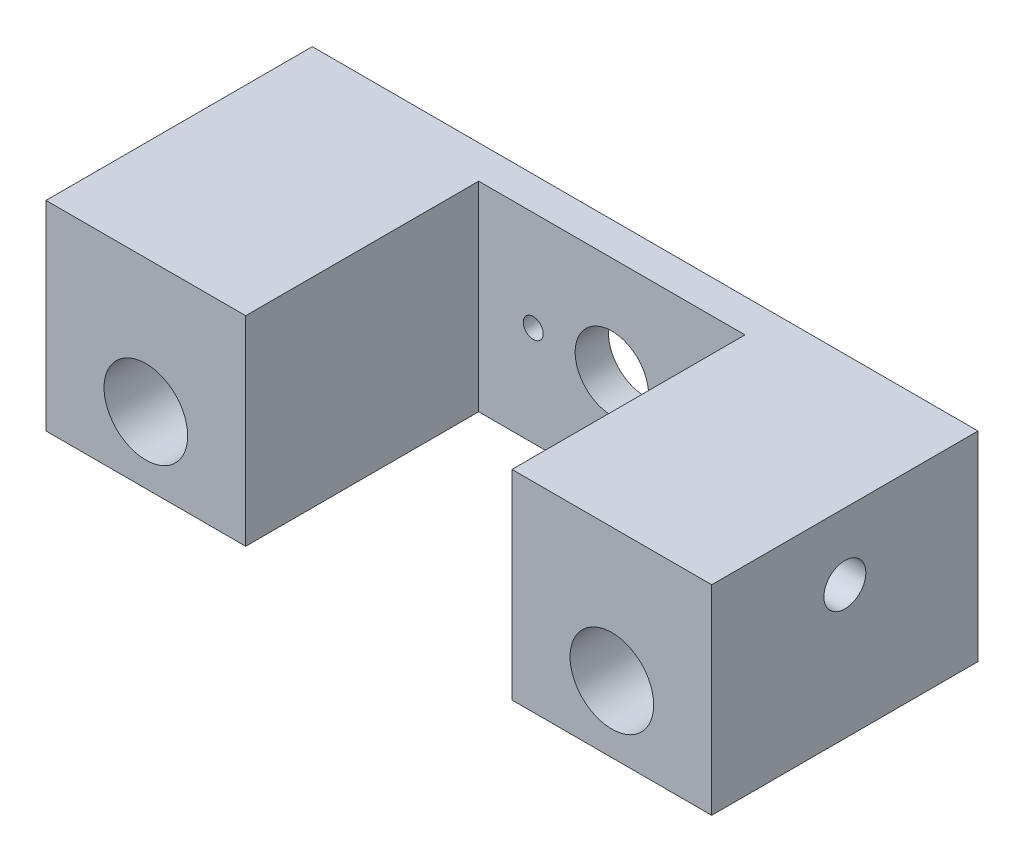
ISO-10303-21;
HEADER;
FILE_DESCRIPTION(('STEP AP214'),'2;1');
FILE_NAME('part.step','',(''),(''),'','','');
FILE_SCHEMA(('AUTOMOTIVE_DESIGN { 1 0 10303 214 1 1 1 1 }'));
ENDSEC;
DATA;
#1=APPLICATION_CONTEXT('core data for automotive mechanical design processes');
#2=APPLICATION_PROTOCOL_DEFINITION('international standard','automotive_design',2000,#1);
#3=PRODUCT_CONTEXT('',#1,'mechanical');
#4=PRODUCT('Part','Part','',(#3));
#5=PRODUCT_RELATED_PRODUCT_CATEGORY('part','',(#4));
#6=PRODUCT_DEFINITION_FORMATION('','',#4);
#7=PRODUCT_DEFINITION_CONTEXT('part definition',#1,'design');
#8=PRODUCT_DEFINITION('design','',#6,#7);
#9=PRODUCT_DEFINITION_SHAPE('','',#8);
#10=(LENGTH_UNIT() NAMED_UNIT(*) SI_UNIT(.MILLI.,.METRE.));
#11=(NAMED_UNIT(*) PLANE_ANGLE_UNIT() SI_UNIT($,.RADIAN.));
#12=(NAMED_UNIT(*) SI_UNIT($,.STERADIAN.) SOLID_ANGLE_UNIT());
#13=UNCERTAINTY_MEASURE_WITH_UNIT(LENGTH_MEASURE(1.E-05),#10,'distance_accuracy_value','');
#14=(GEOMETRIC_REPRESENTATION_CONTEXT(3) GLOBAL_UNCERTAINTY_ASSIGNED_CONTEXT((#13)) GLOBAL_UNIT_ASSIGNED_CONTEXT((#10,
#11,#12)) REPRESENTATION_CONTEXT('',''));
#15=CARTESIAN_POINT('',(0.,0.,0.));
#16=DIRECTION('',(0.,0.,1.));
#17=DIRECTION('',(1.,0.,0.));
#18=AXIS2_PLACEMENT_3D('',#15,#16,#17);
#19=CARTESIAN_POINT('',(0.,0.,0.));
#20=DIRECTION('',(0.,0.,1.));
#21=DIRECTION('',(1.,0.,0.));
#22=AXIS2_PLACEMENT_3D('',#19,#20,#21);
#23=PLANE('',#22);
#24=DIRECTION('',(0.,1.,0.));
#25=VECTOR('',#24,1.);
#26=CARTESIAN_POINT('',(12.7,-9.525,0.));
#27=LINE('',#26,#25);
#28=CARTESIAN_POINT('',(12.7,-9.525,0.));
#29=VERTEX_POINT('',#28);
#30=CARTESIAN_POINT('',(12.7,9.525,0.));
#31=VERTEX_POINT('',#30);
#32=EDGE_CURVE('E117',#29,#31,#27,.T.);
#33=ORIENTED_EDGE('',*,*,#32,.F.);
#34=DIRECTION('',(1.,0.,0.));
#35=VECTOR('',#34,1.);
#36=CARTESIAN_POINT('',(-31.75,-9.52500000000001,0.));
#37=LINE('',#36,#35);
#38=CARTESIAN_POINT('',(31.75,-9.525,0.));
#39=VERTEX_POINT('',#38);
#40=EDGE_CURVE('E84',#29,#39,#37,.T.);
#41=ORIENTED_EDGE('',*,*,#40,.T.);
#42=DIRECTION('',(0.,1.,0.));
#43=VECTOR('',#42,1.);
#44=CARTESIAN_POINT('',(31.75,9.525,0.));
#45=LINE('',#44,#43);
#46=CARTESIAN_POINT('',(31.75,9.525,0.));
#47=VERTEX_POINT('',#46);
#48=EDGE_CURVE('E170',#39,#47,#45,.T.);
#49=ORIENTED_EDGE('',*,*,#48,.T.);
#50=DIRECTION('',(-1.,0.,0.));
#51=VECTOR('',#50,1.);
#52=CARTESIAN_POINT('',(-31.75,9.52499999999999,0.));
#53=LINE('',#52,#51);
#54=EDGE_CURVE('E186',#47,#31,#53,.T.);
#55=ORIENTED_EDGE('',*,*,#54,.T.);
#56=EDGE_LOOP('',(#33,#41,#49,#55));
#57=FACE_BOUND('',#56,.T.);
#58=CARTESIAN_POINT('',(22.225,-3.17500000000001,0.));
#59=DIRECTION('',(0.,0.,1.));
#60=DIRECTION('',(1.,0.,0.));
#61=AXIS2_PLACEMENT_3D('',#58,#59,#60);
#62=CIRCLE('',#61,3.98780000000001);
#63=CARTESIAN_POINT('',(26.2128,-3.17500000000001,0.));
#64=VERTEX_POINT('',#63);
#65=EDGE_CURVE('E158',#64,#64,#62,.T.);
#66=ORIENTED_EDGE('',*,*,#65,.F.);
#67=EDGE_LOOP('',(#66));
#68=FACE_BOUND('',#67,.T.);
#69=ADVANCED_FACE('F37',(#57,#68),#23,.T.);
#70=CARTESIAN_POINT('',(31.75,9.525,-25.4));
#71=DIRECTION('',(1.,0.,0.));
#72=DIRECTION('',(0.,1.,0.));
#73=AXIS2_PLACEMENT_3D('',#70,#71,#72);
#74=PLANE('',#73);
#75=CARTESIAN_POINT('',(31.75,3.17500000000001,-12.7));
#76=DIRECTION('',(-1.,0.,0.));
#77=DIRECTION('',(0.,0.,1.));
#78=AXIS2_PLACEMENT_3D('',#75,#76,#77);
#79=CIRCLE('',#78,2.);
#80=CARTESIAN_POINT('',(31.75,3.17500000000001,-10.7));
#81=VERTEX_POINT('',#80);
#82=EDGE_CURVE('E144',#81,#81,#79,.T.);
#83=ORIENTED_EDGE('',*,*,#82,.T.);
#84=EDGE_LOOP('',(#83));
#85=FACE_BOUND('',#84,.T.);
#86=ORIENTED_EDGE('',*,*,#48,.F.);
#87=DIRECTION('',(0.,0.,1.));
#88=VECTOR('',#87,1.);
#89=CARTESIAN_POINT('',(31.75,-9.525,-25.4));
#90=LINE('',#89,#88);
#91=CARTESIAN_POINT('',(31.75,-9.525,-25.4));
#92=VERTEX_POINT('',#91);
#93=EDGE_CURVE('E11',#92,#39,#90,.T.);
#94=ORIENTED_EDGE('',*,*,#93,.F.);
#95=DIRECTION('',(0.,1.,0.));
#96=VECTOR('',#95,1.);
#97=CARTESIAN_POINT('',(31.75,9.525,-25.4));
#98=LINE('',#97,#96);
#99=CARTESIAN_POINT('',(31.75,9.525,-25.4));
#100=VERTEX_POINT('',#99);
#101=EDGE_CURVE('E173',#92,#100,#98,.T.);
#102=ORIENTED_EDGE('',*,*,#101,.T.);
#103=DIRECTION('',(0.,0.,1.));
#104=VECTOR('',#103,1.);
#105=CARTESIAN_POINT('',(31.75,9.525,-25.4));
#106=LINE('',#105,#104);
#107=EDGE_CURVE('E41',#100,#47,#106,.T.);
#108=ORIENTED_EDGE('',*,*,#107,.T.);
#109=EDGE_LOOP('',(#86,#94,#102,#108));
#110=FACE_BOUND('',#109,.T.);
#111=ADVANCED_FACE('F39',(#85,#110),#74,.T.);
#112=CARTESIAN_POINT('',(-31.75,-9.52500000000001,-25.4));
#113=DIRECTION('',(0.,-1.,0.));
#114=DIRECTION('',(1.,0.,0.));
#115=AXIS2_PLACEMENT_3D('',#112,#113,#114);
#116=PLANE('',#115);
#117=DIRECTION('',(0.,0.,1.));
#118=VECTOR('',#117,1.);
#119=CARTESIAN_POINT('',(12.7,-9.525,-22.225));
#120=LINE('',#119,#118);
#121=CARTESIAN_POINT('',(12.7,-9.525,-22.225));
#122=VERTEX_POINT('',#121);
#123=EDGE_CURVE('E142',#122,#29,#120,.T.);
#124=ORIENTED_EDGE('',*,*,#123,.F.);
#125=DIRECTION('',(1.,0.,0.));
#126=VECTOR('',#125,1.);
#127=CARTESIAN_POINT('',(-12.7,-9.525,-22.225));
#128=LINE('',#127,#126);
#129=CARTESIAN_POINT('',(-12.7,-9.525,-22.225));
#130=VERTEX_POINT('',#129);
#131=EDGE_CURVE('E120',#130,#122,#128,.T.);
#132=ORIENTED_EDGE('',*,*,#131,.F.);
#133=DIRECTION('',(0.,0.,1.));
#134=VECTOR('',#133,1.);
#135=CARTESIAN_POINT('',(-12.7,-9.525,-22.225));
#136=LINE('',#135,#134);
#137=CARTESIAN_POINT('',(-12.7,-9.525,0.));
#138=VERTEX_POINT('',#137);
#139=EDGE_CURVE('E145',#130,#138,#136,.T.);
#140=ORIENTED_EDGE('',*,*,#139,.T.);
#141=CARTESIAN_POINT('',(-31.75,-9.52500000000001,0.));
#142=VERTEX_POINT('',#141);
#143=EDGE_CURVE('E176',#142,#138,#37,.T.);
#144=ORIENTED_EDGE('',*,*,#143,.F.);
#145=DIRECTION('',(0.,0.,1.));
#146=VECTOR('',#145,1.);
#147=CARTESIAN_POINT('',(-31.75,-9.52500000000001,-25.4));
#148=LINE('',#147,#146);
#149=CARTESIAN_POINT('',(-31.75,-9.52500000000001,-25.4));
#150=VERTEX_POINT('',#149);
#151=EDGE_CURVE('E46',#150,#142,#148,.T.);
#152=ORIENTED_EDGE('',*,*,#151,.F.);
#153=DIRECTION('',(1.,0.,0.));
#154=VECTOR('',#153,1.);
#155=CARTESIAN_POINT('',(-31.75,-9.52500000000001,-25.4));
#156=LINE('',#155,#154);
#157=EDGE_CURVE('E181',#150,#92,#156,.T.);
#158=ORIENTED_EDGE('',*,*,#157,.T.);
#159=ORIENTED_EDGE('',*,*,#93,.T.);
#160=ORIENTED_EDGE('',*,*,#40,.F.);
#161=EDGE_LOOP('',(#124,#132,#140,#144,#152,#158,#159,#160));
#162=FACE_BOUND('',#161,.T.);
#163=ADVANCED_FACE('F226',(#162),#116,.T.);
#164=CARTESIAN_POINT('',(-31.75,9.52499999999999,-25.4));
#165=DIRECTION('',(-1.,0.,0.));
#166=DIRECTION('',(0.,-1.,0.));
#167=AXIS2_PLACEMENT_3D('',#164,#165,#166);
#168=PLANE('',#167);
#169=CARTESIAN_POINT('',(-31.75,3.175,-12.7));
#170=DIRECTION('',(-1.,0.,0.));
#171=DIRECTION('',(0.,0.,1.));
#172=AXIS2_PLACEMENT_3D('',#169,#170,#171);
#173=CIRCLE('',#172,2.);
#174=CARTESIAN_POINT('',(-31.75,3.175,-10.7));
#175=VERTEX_POINT('',#174);
#176=EDGE_CURVE('E152',#175,#175,#173,.T.);
#177=ORIENTED_EDGE('',*,*,#176,.F.);
#178=EDGE_LOOP('',(#177));
#179=FACE_BOUND('',#178,.T.);
#180=DIRECTION('',(0.,-1.,0.));
#181=VECTOR('',#180,1.);
#182=CARTESIAN_POINT('',(-31.75,9.52499999999999,0.));
#183=LINE('',#182,#181);
#184=CARTESIAN_POINT('',(-31.75,9.52499999999999,0.));
#185=VERTEX_POINT('',#184);
#186=EDGE_CURVE('E188',#185,#142,#183,.T.);
#187=ORIENTED_EDGE('',*,*,#186,.F.);
#188=DIRECTION('',(0.,0.,1.));
#189=VECTOR('',#188,1.);
#190=CARTESIAN_POINT('',(-31.75,9.52499999999999,-25.4));
#191=LINE('',#190,#189);
#192=CARTESIAN_POINT('',(-31.75,9.52499999999999,-25.4));
#193=VERTEX_POINT('',#192);
#194=EDGE_CURVE('E193',#193,#185,#191,.T.);
#195=ORIENTED_EDGE('',*,*,#194,.F.);
#196=DIRECTION('',(0.,-1.,0.));
#197=VECTOR('',#196,1.);
#198=CARTESIAN_POINT('',(-31.75,9.52499999999999,-25.4));
#199=LINE('',#198,#197);
#200=EDGE_CURVE('E178',#193,#150,#199,.T.);
#201=ORIENTED_EDGE('',*,*,#200,.T.);
#202=ORIENTED_EDGE('',*,*,#151,.T.);
#203=EDGE_LOOP('',(#187,#195,#201,#202));
#204=FACE_BOUND('',#203,.T.);
#205=ADVANCED_FACE('F229',(#179,#204),#168,.T.);
#206=CARTESIAN_POINT('',(-31.75,9.52499999999999,-25.4));
#207=DIRECTION('',(0.,1.,0.));
#208=DIRECTION('',(-1.,0.,0.));
#209=AXIS2_PLACEMENT_3D('',#206,#207,#208);
#210=PLANE('',#209);
#211=DIRECTION('',(0.,0.,1.));
#212=VECTOR('',#211,1.);
#213=CARTESIAN_POINT('',(12.7,9.525,-22.225));
#214=LINE('',#213,#212);
#215=CARTESIAN_POINT('',(12.7,9.525,-22.225));
#216=VERTEX_POINT('',#215);
#217=EDGE_CURVE('E112',#216,#31,#214,.T.);
#218=ORIENTED_EDGE('',*,*,#217,.T.);
#219=ORIENTED_EDGE('',*,*,#54,.F.);
#220=ORIENTED_EDGE('',*,*,#107,.F.);
#221=DIRECTION('',(-1.,0.,0.));
#222=VECTOR('',#221,1.);
#223=CARTESIAN_POINT('',(-31.75,9.52499999999999,-25.4));
#224=LINE('',#223,#222);
#225=EDGE_CURVE('E175',#100,#193,#224,.T.);
#226=ORIENTED_EDGE('',*,*,#225,.T.);
#227=ORIENTED_EDGE('',*,*,#194,.T.);
#228=CARTESIAN_POINT('',(-12.7,9.52499999999999,0.));
#229=VERTEX_POINT('',#228);
#230=EDGE_CURVE('E185',#229,#185,#53,.T.);
#231=ORIENTED_EDGE('',*,*,#230,.F.);
#232=DIRECTION('',(0.,0.,1.));
#233=VECTOR('',#232,1.);
#234=CARTESIAN_POINT('',(-12.7,9.525,-22.225));
#235=LINE('',#234,#233);
#236=CARTESIAN_POINT('',(-12.7,9.525,-22.225));
#237=VERTEX_POINT('',#236);
#238=EDGE_CURVE('E54',#237,#229,#235,.T.);
#239=ORIENTED_EDGE('',*,*,#238,.F.);
#240=DIRECTION('',(-1.,0.,0.));
#241=VECTOR('',#240,1.);
#242=CARTESIAN_POINT('',(-12.7,9.525,-22.225));
#243=LINE('',#242,#241);
#244=EDGE_CURVE('E126',#216,#237,#243,.T.);
#245=ORIENTED_EDGE('',*,*,#244,.F.);
#246=EDGE_LOOP('',(#218,#219,#220,#226,#227,#231,#239,#245));
#247=FACE_BOUND('',#246,.T.);
#248=ADVANCED_FACE('F131',(#247),#210,.T.);
#249=CARTESIAN_POINT('',(0.,0.,-25.4));
#250=DIRECTION('',(0.,0.,1.));
#251=DIRECTION('',(1.,0.,0.));
#252=AXIS2_PLACEMENT_3D('',#249,#250,#251);
#253=PLANE('',#252);
#254=CARTESIAN_POINT('',(7.50000000000153,9.56526524653611E-12,-25.4));
#255=DIRECTION('',(0.,0.,1.));
#256=DIRECTION('',(1.,0.,0.));
#257=AXIS2_PLACEMENT_3D('',#254,#255,#256);
#258=CIRCLE('',#257,0.94999999999412);
#259=CARTESIAN_POINT('',(8.44999999999565,9.56526524653611E-12,-25.4));
#260=VERTEX_POINT('',#259);
#261=EDGE_CURVE('E419',#260,#260,#258,.T.);
#262=ORIENTED_EDGE('',*,*,#261,.T.);
#263=EDGE_LOOP('',(#262));
#264=FACE_BOUND('',#263,.T.);
#265=CARTESIAN_POINT('',(-7.49999999999847,7.68829444552921E-12,-25.4));
#266=DIRECTION('',(0.,0.,1.));
#267=DIRECTION('',(1.,0.,0.));
#268=AXIS2_PLACEMENT_3D('',#265,#266,#267);
#269=CIRCLE('',#268,0.94999999999464);
#270=CARTESIAN_POINT('',(-6.55000000000383,7.68829444552921E-12,-25.4));
#271=VERTEX_POINT('',#270);
#272=EDGE_CURVE('E423',#271,#271,#269,.T.);
#273=ORIENTED_EDGE('',*,*,#272,.T.);
#274=EDGE_LOOP('',(#273));
#275=FACE_BOUND('',#274,.T.);
#276=CARTESIAN_POINT('',(1.5334955527635E-12,8.62157567560473E-12,-25.4));
#277=DIRECTION('',(0.,0.,1.));
#278=DIRECTION('',(1.,0.,0.));
#279=AXIS2_PLACEMENT_3D('',#276,#277,#278);
#280=CIRCLE('',#279,3.49999999998743);
#281=CARTESIAN_POINT('',(3.49999999998896,8.62157567560473E-12,-25.4));
#282=VERTEX_POINT('',#281);
#283=EDGE_CURVE('E140',#282,#282,#280,.T.);
#284=ORIENTED_EDGE('',*,*,#283,.T.);
#285=EDGE_LOOP('',(#284));
#286=FACE_BOUND('',#285,.T.);
#287=CARTESIAN_POINT('',(22.225,-3.17500000000001,-25.4));
#288=DIRECTION('',(0.,0.,1.));
#289=DIRECTION('',(1.,0.,0.));
#290=AXIS2_PLACEMENT_3D('',#287,#288,#289);
#291=CIRCLE('',#290,3.98780000000001);
#292=CARTESIAN_POINT('',(26.2128,-3.17500000000001,-25.4));
#293=VERTEX_POINT('',#292);
#294=EDGE_CURVE('E161',#293,#293,#291,.T.);
#295=ORIENTED_EDGE('',*,*,#294,.T.);
#296=EDGE_LOOP('',(#295));
#297=FACE_BOUND('',#296,.T.);
#298=CARTESIAN_POINT('',(-22.225,-3.17500000000001,-25.4));
#299=DIRECTION('',(0.,0.,1.));
#300=DIRECTION('',(1.,0.,0.));
#301=AXIS2_PLACEMENT_3D('',#298,#299,#300);
#302=CIRCLE('',#301,3.9878);
#303=CARTESIAN_POINT('',(-18.2372,-3.17500000000001,-25.4));
#304=VERTEX_POINT('',#303);
#305=EDGE_CURVE('E167',#304,#304,#302,.T.);
#306=ORIENTED_EDGE('',*,*,#305,.T.);
#307=EDGE_LOOP('',(#306));
#308=FACE_BOUND('',#307,.T.);
#309=ORIENTED_EDGE('',*,*,#101,.F.);
#310=ORIENTED_EDGE('',*,*,#157,.F.);
#311=ORIENTED_EDGE('',*,*,#200,.F.);
#312=ORIENTED_EDGE('',*,*,#225,.F.);
#313=EDGE_LOOP('',(#309,#310,#311,#312));
#314=FACE_BOUND('',#313,.T.);
#315=ADVANCED_FACE('F220',(#264,#275,#286,#297,#308,#314),#253,.F.);
#316=DIRECTION('',(0.,-1.,0.));
#317=VECTOR('',#316,1.);
#318=CARTESIAN_POINT('',(-12.7,-9.525,0.));
#319=LINE('',#318,#317);
#320=EDGE_CURVE('E129',#229,#138,#319,.T.);
#321=ORIENTED_EDGE('',*,*,#320,.F.);
#322=ORIENTED_EDGE('',*,*,#230,.T.);
#323=ORIENTED_EDGE('',*,*,#186,.T.);
#324=ORIENTED_EDGE('',*,*,#143,.T.);
#325=EDGE_LOOP('',(#321,#322,#323,#324));
#326=FACE_BOUND('',#325,.T.);
#327=CARTESIAN_POINT('',(-22.225,-3.17500000000001,0.));
#328=DIRECTION('',(0.,0.,1.));
#329=DIRECTION('',(1.,0.,0.));
#330=AXIS2_PLACEMENT_3D('',#327,#328,#329);
#331=CIRCLE('',#330,3.9878);
#332=CARTESIAN_POINT('',(-18.2372,-3.17500000000001,0.));
#333=VERTEX_POINT('',#332);
#334=EDGE_CURVE('E164',#333,#333,#331,.T.);
#335=ORIENTED_EDGE('',*,*,#334,.F.);
#336=EDGE_LOOP('',(#335));
#337=FACE_BOUND('',#336,.T.);
#338=ADVANCED_FACE('F199',(#326,#337),#23,.T.);
#339=CARTESIAN_POINT('',(-22.225,-3.17500000000001,-25.4));
#340=DIRECTION('',(0.,0.,1.));
#341=DIRECTION('',(1.,0.,0.));
#342=AXIS2_PLACEMENT_3D('',#339,#340,#341);
#343=CYLINDRICAL_SURFACE('',#342,3.9878);
#344=ORIENTED_EDGE('',*,*,#305,.F.);
#345=EDGE_LOOP('',(#344));
#346=FACE_BOUND('',#345,.T.);
#347=ORIENTED_EDGE('',*,*,#334,.T.);
#348=EDGE_LOOP('',(#347));
#349=FACE_BOUND('',#348,.T.);
#350=ADVANCED_FACE('F205',(#346,#349),#343,.F.);
#351=CARTESIAN_POINT('',(22.225,-3.17500000000001,-25.4));
#352=DIRECTION('',(0.,0.,1.));
#353=DIRECTION('',(1.,0.,0.));
#354=AXIS2_PLACEMENT_3D('',#351,#352,#353);
#355=CYLINDRICAL_SURFACE('',#354,3.98780000000001);
#356=ORIENTED_EDGE('',*,*,#294,.F.);
#357=EDGE_LOOP('',(#356));
#358=FACE_BOUND('',#357,.T.);
#359=ORIENTED_EDGE('',*,*,#65,.T.);
#360=EDGE_LOOP('',(#359));
#361=FACE_BOUND('',#360,.T.);
#362=ADVANCED_FACE('F202',(#358,#361),#355,.F.);
#363=CARTESIAN_POINT('',(-25.4,3.175,-12.7));
#364=DIRECTION('',(-1.,0.,0.));
#365=DIRECTION('',(0.,0.,1.));
#366=AXIS2_PLACEMENT_3D('',#363,#364,#365);
#367=CYLINDRICAL_SURFACE('',#366,2.);
#368=CARTESIAN_POINT('',(-25.4,3.175,-12.7));
#369=DIRECTION('',(-1.,0.,0.));
#370=DIRECTION('',(0.,0.,1.));
#371=AXIS2_PLACEMENT_3D('',#368,#369,#370);
#372=CIRCLE('',#371,2.);
#373=CARTESIAN_POINT('',(-25.4,3.175,-10.7));
#374=VERTEX_POINT('',#373);
#375=EDGE_CURVE('E155',#374,#374,#372,.T.);
#376=ORIENTED_EDGE('',*,*,#375,.F.);
#377=EDGE_LOOP('',(#376));
#378=FACE_BOUND('',#377,.T.);
#379=ORIENTED_EDGE('',*,*,#176,.T.);
#380=EDGE_LOOP('',(#379));
#381=FACE_BOUND('',#380,.T.);
#382=ADVANCED_FACE('F204',(#378,#381),#367,.F.);
#383=CARTESIAN_POINT('',(-25.4,3.175,-12.7));
#384=DIRECTION('',(-1.,0.,0.));
#385=DIRECTION('',(0.,0.,1.));
#386=AXIS2_PLACEMENT_3D('',#383,#384,#385);
#387=PLANE('',#386);
#388=ORIENTED_EDGE('',*,*,#375,.T.);
#389=EDGE_LOOP('',(#388));
#390=FACE_BOUND('',#389,.T.);
#391=ADVANCED_FACE('F212',(#390),#387,.T.);
#392=CARTESIAN_POINT('',(25.4,3.17500000000001,-12.7));
#393=DIRECTION('',(1.,0.,0.));
#394=DIRECTION('',(0.,1.,0.));
#395=AXIS2_PLACEMENT_3D('',#392,#393,#394);
#396=CYLINDRICAL_SURFACE('',#395,2.);
#397=CARTESIAN_POINT('',(25.4,3.17500000000001,-12.7));
#398=DIRECTION('',(-1.,0.,0.));
#399=DIRECTION('',(0.,0.,1.));
#400=AXIS2_PLACEMENT_3D('',#397,#398,#399);
#401=CIRCLE('',#400,2.);
#402=CARTESIAN_POINT('',(25.4,3.17500000000001,-10.7));
#403=VERTEX_POINT('',#402);
#404=EDGE_CURVE('E149',#403,#403,#401,.T.);
#405=ORIENTED_EDGE('',*,*,#404,.T.);
#406=EDGE_LOOP('',(#405));
#407=FACE_BOUND('',#406,.T.);
#408=ORIENTED_EDGE('',*,*,#82,.F.);
#409=EDGE_LOOP('',(#408));
#410=FACE_BOUND('',#409,.T.);
#411=ADVANCED_FACE('F285',(#407,#410),#396,.F.);
#412=CARTESIAN_POINT('',(25.4,3.17500000000001,-12.7));
#413=DIRECTION('',(1.,0.,0.));
#414=DIRECTION('',(0.,0.,1.));
#415=AXIS2_PLACEMENT_3D('',#412,#413,#414);
#416=PLANE('',#415);
#417=ORIENTED_EDGE('',*,*,#404,.F.);
#418=EDGE_LOOP('',(#417));
#419=FACE_BOUND('',#418,.T.);
#420=ADVANCED_FACE('F304',(#419),#416,.T.);
#421=CARTESIAN_POINT('',(12.7,-9.525,-22.225));
#422=DIRECTION('',(1.,0.,0.));
#423=DIRECTION('',(0.,0.,-1.));
#424=AXIS2_PLACEMENT_3D('',#421,#422,#423);
#425=PLANE('',#424);
#426=ORIENTED_EDGE('',*,*,#32,.T.);
#427=ORIENTED_EDGE('',*,*,#217,.F.);
#428=DIRECTION('',(0.,1.,0.));
#429=VECTOR('',#428,1.);
#430=CARTESIAN_POINT('',(12.7,-9.525,-22.225));
#431=LINE('',#430,#429);
#432=EDGE_CURVE('E115',#122,#216,#431,.T.);
#433=ORIENTED_EDGE('',*,*,#432,.F.);
#434=ORIENTED_EDGE('',*,*,#123,.T.);
#435=EDGE_LOOP('',(#426,#427,#433,#434));
#436=FACE_BOUND('',#435,.T.);
#437=ADVANCED_FACE('F114',(#436),#425,.F.);
#438=CARTESIAN_POINT('',(-12.7,-9.525,-22.225));
#439=DIRECTION('',(-1.,0.,0.));
#440=DIRECTION('',(0.,0.,1.));
#441=AXIS2_PLACEMENT_3D('',#438,#439,#440);
#442=PLANE('',#441);
#443=ORIENTED_EDGE('',*,*,#320,.T.);
#444=ORIENTED_EDGE('',*,*,#139,.F.);
#445=DIRECTION('',(0.,-1.,0.));
#446=VECTOR('',#445,1.);
#447=CARTESIAN_POINT('',(-12.7,-9.525,-22.225));
#448=LINE('',#447,#446);
#449=EDGE_CURVE('E133',#237,#130,#448,.T.);
#450=ORIENTED_EDGE('',*,*,#449,.F.);
#451=ORIENTED_EDGE('',*,*,#238,.T.);
#452=EDGE_LOOP('',(#443,#444,#450,#451));
#453=FACE_BOUND('',#452,.T.);
#454=ADVANCED_FACE('F356',(#453),#442,.F.);
#455=CARTESIAN_POINT('',(0.,0.,-22.225));
#456=DIRECTION('',(0.,0.,-1.));
#457=DIRECTION('',(-1.,0.,0.));
#458=AXIS2_PLACEMENT_3D('',#455,#456,#457);
#459=PLANE('',#458);
#460=CARTESIAN_POINT('',(7.50000000000153,9.56526524653611E-12,-22.225));
#461=DIRECTION('',(0.,0.,1.));
#462=DIRECTION('',(1.,0.,0.));
#463=AXIS2_PLACEMENT_3D('',#460,#461,#462);
#464=CIRCLE('',#463,0.94999999999412);
#465=CARTESIAN_POINT('',(8.44999999999565,9.56526524653611E-12,-22.225));
#466=VERTEX_POINT('',#465);
#467=EDGE_CURVE('E422',#466,#466,#464,.T.);
#468=ORIENTED_EDGE('',*,*,#467,.F.);
#469=EDGE_LOOP('',(#468));
#470=FACE_BOUND('',#469,.T.);
#471=CARTESIAN_POINT('',(-7.49999999999847,7.68829444552921E-12,-22.225));
#472=DIRECTION('',(0.,0.,1.));
#473=DIRECTION('',(1.,0.,0.));
#474=AXIS2_PLACEMENT_3D('',#471,#472,#473);
#475=CIRCLE('',#474,0.94999999999464);
#476=CARTESIAN_POINT('',(-6.55000000000383,7.68829444552921E-12,-22.225));
#477=VERTEX_POINT('',#476);
#478=EDGE_CURVE('E426',#477,#477,#475,.T.);
#479=ORIENTED_EDGE('',*,*,#478,.F.);
#480=EDGE_LOOP('',(#479));
#481=FACE_BOUND('',#480,.T.);
#482=CARTESIAN_POINT('',(1.5334955527635E-12,8.62157567560473E-12,-22.225));
#483=DIRECTION('',(0.,0.,1.));
#484=DIRECTION('',(1.,0.,0.));
#485=AXIS2_PLACEMENT_3D('',#482,#483,#484);
#486=CIRCLE('',#485,3.49999999998743);
#487=CARTESIAN_POINT('',(3.49999999998896,8.62157567560473E-12,-22.225));
#488=VERTEX_POINT('',#487);
#489=EDGE_CURVE('E432',#488,#488,#486,.T.);
#490=ORIENTED_EDGE('',*,*,#489,.F.);
#491=EDGE_LOOP('',(#490));
#492=FACE_BOUND('',#491,.T.);
#493=ORIENTED_EDGE('',*,*,#432,.T.);
#494=ORIENTED_EDGE('',*,*,#244,.T.);
#495=ORIENTED_EDGE('',*,*,#449,.T.);
#496=ORIENTED_EDGE('',*,*,#131,.T.);
#497=EDGE_LOOP('',(#493,#494,#495,#496));
#498=FACE_BOUND('',#497,.T.);
#499=ADVANCED_FACE('F124',(#470,#481,#492,#498),#459,.F.);
#500=CARTESIAN_POINT('',(1.5334955527635E-12,8.62157567560473E-12,-25.4));
#501=DIRECTION('',(0.,0.,1.));
#502=DIRECTION('',(1.,0.,0.));
#503=AXIS2_PLACEMENT_3D('',#500,#501,#502);
#504=CYLINDRICAL_SURFACE('',#503,3.49999999998743);
#505=ORIENTED_EDGE('',*,*,#283,.F.);
#506=EDGE_LOOP('',(#505));
#507=FACE_BOUND('',#506,.T.);
#508=ORIENTED_EDGE('',*,*,#489,.T.);
#509=EDGE_LOOP('',(#508));
#510=FACE_BOUND('',#509,.T.);
#511=ADVANCED_FACE('F370',(#507,#510),#504,.F.);
#512=CARTESIAN_POINT('',(-7.49999999999847,7.68829444552921E-12,-25.4));
#513=DIRECTION('',(0.,0.,1.));
#514=DIRECTION('',(1.,0.,0.));
#515=AXIS2_PLACEMENT_3D('',#512,#513,#514);
#516=CYLINDRICAL_SURFACE('',#515,0.94999999999464);
#517=ORIENTED_EDGE('',*,*,#272,.F.);
#518=EDGE_LOOP('',(#517));
#519=FACE_BOUND('',#518,.T.);
#520=ORIENTED_EDGE('',*,*,#478,.T.);
#521=EDGE_LOOP('',(#520));
#522=FACE_BOUND('',#521,.T.);
#523=ADVANCED_FACE('F380',(#519,#522),#516,.F.);
#524=CARTESIAN_POINT('',(7.50000000000153,9.56526524653611E-12,-25.4));
#525=DIRECTION('',(0.,0.,1.));
#526=DIRECTION('',(1.,0.,0.));
#527=AXIS2_PLACEMENT_3D('',#524,#525,#526);
#528=CYLINDRICAL_SURFACE('',#527,0.94999999999412);
#529=ORIENTED_EDGE('',*,*,#261,.F.);
#530=EDGE_LOOP('',(#529));
#531=FACE_BOUND('',#530,.T.);
#532=ORIENTED_EDGE('',*,*,#467,.T.);
#533=EDGE_LOOP('',(#532));
#534=FACE_BOUND('',#533,.T.);
#535=ADVANCED_FACE('F390',(#531,#534),#528,.F.);
#536=CLOSED_SHELL('',(#69,#111,#163,#205,#248,#315,#338,#350,#362,#382,#391,#411,#420,#437,#454,
#499,#511,#523,#535));
#537=MANIFOLD_SOLID_BREP('B2',#536);
#538=ADVANCED_BREP_SHAPE_REPRESENTATION('',(#18,#537),#14);
#539=SHAPE_DEFINITION_REPRESENTATION(#9,#538);
ENDSEC;
END-ISO-10303-21;
